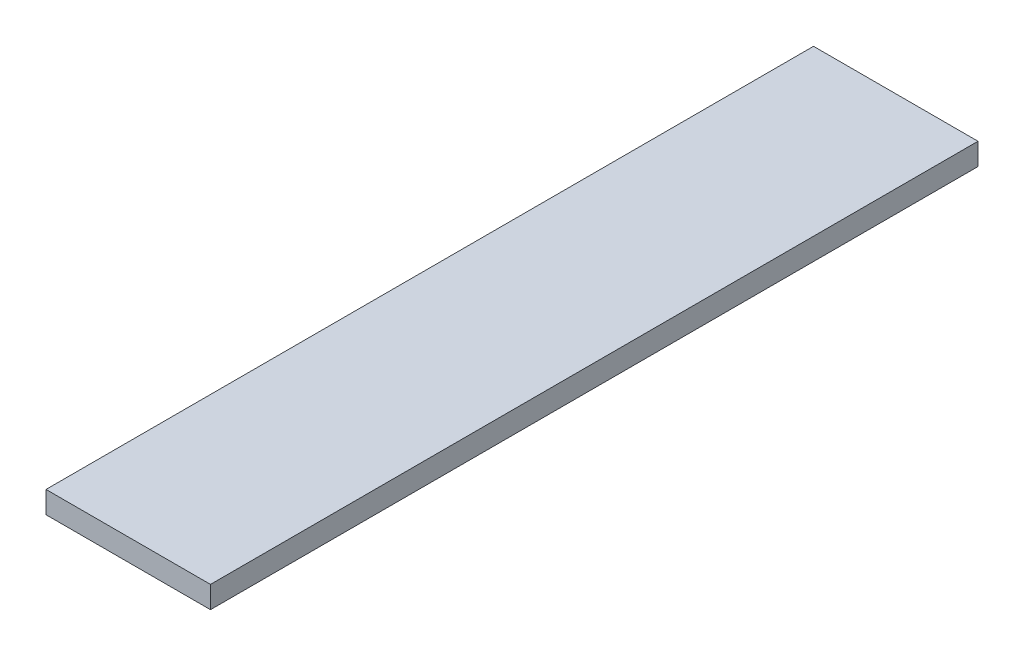
ISO-10303-21;
HEADER;
FILE_DESCRIPTION(('STEP AP214'),'2;1');
FILE_NAME('part.step','',(''),(''),'','','');
FILE_SCHEMA(('AUTOMOTIVE_DESIGN { 1 0 10303 214 1 1 1 1 }'));
ENDSEC;
DATA;
#1=APPLICATION_CONTEXT('core data for automotive mechanical design processes');
#2=APPLICATION_PROTOCOL_DEFINITION('international standard','automotive_design',2000,#1);
#3=PRODUCT_CONTEXT('',#1,'mechanical');
#4=PRODUCT('Part','Part','',(#3));
#5=PRODUCT_RELATED_PRODUCT_CATEGORY('part','',(#4));
#6=PRODUCT_DEFINITION_FORMATION('','',#4);
#7=PRODUCT_DEFINITION_CONTEXT('part definition',#1,'design');
#8=PRODUCT_DEFINITION('design','',#6,#7);
#9=PRODUCT_DEFINITION_SHAPE('','',#8);
#10=(LENGTH_UNIT() NAMED_UNIT(*) SI_UNIT(.MILLI.,.METRE.));
#11=(NAMED_UNIT(*) PLANE_ANGLE_UNIT() SI_UNIT($,.RADIAN.));
#12=(NAMED_UNIT(*) SI_UNIT($,.STERADIAN.) SOLID_ANGLE_UNIT());
#13=UNCERTAINTY_MEASURE_WITH_UNIT(LENGTH_MEASURE(1.E-05),#10,'distance_accuracy_value','');
#14=(GEOMETRIC_REPRESENTATION_CONTEXT(3) GLOBAL_UNCERTAINTY_ASSIGNED_CONTEXT((#13)) GLOBAL_UNIT_ASSIGNED_CONTEXT((#10,
#11,#12)) REPRESENTATION_CONTEXT('',''));
#15=CARTESIAN_POINT('',(0.,0.,0.));
#16=DIRECTION('',(0.,0.,1.));
#17=DIRECTION('',(1.,0.,0.));
#18=AXIS2_PLACEMENT_3D('',#15,#16,#17);
#19=CARTESIAN_POINT('',(0.,20.,0.));
#20=DIRECTION('',(1.,0.,0.));
#21=DIRECTION('',(0.,0.,-1.));
#22=AXIS2_PLACEMENT_3D('',#19,#20,#21);
#23=PLANE('',#22);
#24=DIRECTION('',(0.,0.,1.));
#25=VECTOR('',#24,1.);
#26=CARTESIAN_POINT('',(0.,0.,0.));
#27=LINE('',#26,#25);
#28=CARTESIAN_POINT('',(0.,0.,-700.));
#29=VERTEX_POINT('',#28);
#30=CARTESIAN_POINT('',(0.,0.,0.));
#31=VERTEX_POINT('',#30);
#32=EDGE_CURVE('E96',#29,#31,#27,.T.);
#33=ORIENTED_EDGE('',*,*,#32,.T.);
#34=DIRECTION('',(0.,-1.,0.));
#35=VECTOR('',#34,1.);
#36=CARTESIAN_POINT('',(0.,20.,0.));
#37=LINE('',#36,#35);
#38=CARTESIAN_POINT('',(0.,20.,0.));
#39=VERTEX_POINT('',#38);
#40=EDGE_CURVE('E11',#39,#31,#37,.T.);
#41=ORIENTED_EDGE('',*,*,#40,.F.);
#42=DIRECTION('',(0.,0.,1.));
#43=VECTOR('',#42,1.);
#44=CARTESIAN_POINT('',(0.,20.,0.));
#45=LINE('',#44,#43);
#46=CARTESIAN_POINT('',(0.,20.,-700.));
#47=VERTEX_POINT('',#46);
#48=EDGE_CURVE('E84',#47,#39,#45,.T.);
#49=ORIENTED_EDGE('',*,*,#48,.F.);
#50=DIRECTION('',(0.,-1.,0.));
#51=VECTOR('',#50,1.);
#52=CARTESIAN_POINT('',(0.,20.,-700.));
#53=LINE('',#52,#51);
#54=EDGE_CURVE('E92',#47,#29,#53,.T.);
#55=ORIENTED_EDGE('',*,*,#54,.T.);
#56=EDGE_LOOP('',(#33,#41,#49,#55));
#57=FACE_BOUND('',#56,.T.);
#58=ADVANCED_FACE('F33',(#57),#23,.F.);
#59=CARTESIAN_POINT('',(0.,20.,0.));
#60=DIRECTION('',(0.,0.,-1.));
#61=DIRECTION('',(-1.,0.,0.));
#62=AXIS2_PLACEMENT_3D('',#59,#60,#61);
#63=PLANE('',#62);
#64=DIRECTION('',(1.,0.,0.));
#65=VECTOR('',#64,1.);
#66=CARTESIAN_POINT('',(0.,0.,0.));
#67=LINE('',#66,#65);
#68=CARTESIAN_POINT('',(150.,0.,0.));
#69=VERTEX_POINT('',#68);
#70=EDGE_CURVE('E88',#31,#69,#67,.T.);
#71=ORIENTED_EDGE('',*,*,#70,.T.);
#72=DIRECTION('',(0.,-1.,0.));
#73=VECTOR('',#72,1.);
#74=CARTESIAN_POINT('',(150.,20.,0.));
#75=LINE('',#74,#73);
#76=CARTESIAN_POINT('',(150.,20.,0.));
#77=VERTEX_POINT('',#76);
#78=EDGE_CURVE('E41',#77,#69,#75,.T.);
#79=ORIENTED_EDGE('',*,*,#78,.F.);
#80=DIRECTION('',(1.,0.,0.));
#81=VECTOR('',#80,1.);
#82=CARTESIAN_POINT('',(0.,20.,0.));
#83=LINE('',#82,#81);
#84=EDGE_CURVE('E79',#39,#77,#83,.T.);
#85=ORIENTED_EDGE('',*,*,#84,.F.);
#86=ORIENTED_EDGE('',*,*,#40,.T.);
#87=EDGE_LOOP('',(#71,#79,#85,#86));
#88=FACE_BOUND('',#87,.T.);
#89=ADVANCED_FACE('F87',(#88),#63,.F.);
#90=CARTESIAN_POINT('',(150.,20.,0.));
#91=DIRECTION('',(-1.,0.,0.));
#92=DIRECTION('',(0.,0.,1.));
#93=AXIS2_PLACEMENT_3D('',#90,#91,#92);
#94=PLANE('',#93);
#95=DIRECTION('',(0.,0.,-1.));
#96=VECTOR('',#95,1.);
#97=CARTESIAN_POINT('',(150.,0.,0.));
#98=LINE('',#97,#96);
#99=CARTESIAN_POINT('',(150.,0.,-700.));
#100=VERTEX_POINT('',#99);
#101=EDGE_CURVE('E66',#69,#100,#98,.T.);
#102=ORIENTED_EDGE('',*,*,#101,.T.);
#103=DIRECTION('',(0.,-1.,0.));
#104=VECTOR('',#103,1.);
#105=CARTESIAN_POINT('',(150.,20.,-700.));
#106=LINE('',#105,#104);
#107=CARTESIAN_POINT('',(150.,20.,-700.));
#108=VERTEX_POINT('',#107);
#109=EDGE_CURVE('E89',#108,#100,#106,.T.);
#110=ORIENTED_EDGE('',*,*,#109,.F.);
#111=DIRECTION('',(0.,0.,-1.));
#112=VECTOR('',#111,1.);
#113=CARTESIAN_POINT('',(150.,20.,0.));
#114=LINE('',#113,#112);
#115=EDGE_CURVE('E82',#77,#108,#114,.T.);
#116=ORIENTED_EDGE('',*,*,#115,.F.);
#117=ORIENTED_EDGE('',*,*,#78,.T.);
#118=EDGE_LOOP('',(#102,#110,#116,#117));
#119=FACE_BOUND('',#118,.T.);
#120=ADVANCED_FACE('F90',(#119),#94,.F.);
#121=CARTESIAN_POINT('',(0.,20.,-700.));
#122=DIRECTION('',(0.,0.,1.));
#123=DIRECTION('',(1.,0.,0.));
#124=AXIS2_PLACEMENT_3D('',#121,#122,#123);
#125=PLANE('',#124);
#126=DIRECTION('',(-1.,0.,0.));
#127=VECTOR('',#126,1.);
#128=CARTESIAN_POINT('',(0.,0.,-700.));
#129=LINE('',#128,#127);
#130=EDGE_CURVE('E72',#100,#29,#129,.T.);
#131=ORIENTED_EDGE('',*,*,#130,.T.);
#132=ORIENTED_EDGE('',*,*,#54,.F.);
#133=DIRECTION('',(-1.,0.,0.));
#134=VECTOR('',#133,1.);
#135=CARTESIAN_POINT('',(0.,20.,-700.));
#136=LINE('',#135,#134);
#137=EDGE_CURVE('E49',#108,#47,#136,.T.);
#138=ORIENTED_EDGE('',*,*,#137,.F.);
#139=ORIENTED_EDGE('',*,*,#109,.T.);
#140=EDGE_LOOP('',(#131,#132,#138,#139));
#141=FACE_BOUND('',#140,.T.);
#142=ADVANCED_FACE('F103',(#141),#125,.F.);
#143=CARTESIAN_POINT('',(0.,20.,0.));
#144=DIRECTION('',(0.,-1.,0.));
#145=DIRECTION('',(0.,0.,-1.));
#146=AXIS2_PLACEMENT_3D('',#143,#144,#145);
#147=PLANE('',#146);
#148=ORIENTED_EDGE('',*,*,#48,.T.);
#149=ORIENTED_EDGE('',*,*,#84,.T.);
#150=ORIENTED_EDGE('',*,*,#115,.T.);
#151=ORIENTED_EDGE('',*,*,#137,.T.);
#152=EDGE_LOOP('',(#148,#149,#150,#151));
#153=FACE_BOUND('',#152,.T.);
#154=ADVANCED_FACE('F80',(#153),#147,.F.);
#155=CARTESIAN_POINT('',(0.,0.,0.));
#156=DIRECTION('',(0.,-1.,0.));
#157=DIRECTION('',(0.,0.,-1.));
#158=AXIS2_PLACEMENT_3D('',#155,#156,#157);
#159=PLANE('',#158);
#160=ORIENTED_EDGE('',*,*,#32,.F.);
#161=ORIENTED_EDGE('',*,*,#130,.F.);
#162=ORIENTED_EDGE('',*,*,#101,.F.);
#163=ORIENTED_EDGE('',*,*,#70,.F.);
#164=EDGE_LOOP('',(#160,#161,#162,#163));
#165=FACE_BOUND('',#164,.T.);
#166=ADVANCED_FACE('F106',(#165),#159,.T.);
#167=CLOSED_SHELL('',(#58,#89,#120,#142,#154,#166));
#168=MANIFOLD_SOLID_BREP('B2',#167);
#169=ADVANCED_BREP_SHAPE_REPRESENTATION('',(#18,#168),#14);
#170=SHAPE_DEFINITION_REPRESENTATION(#9,#169);
ENDSEC;
END-ISO-10303-21;
